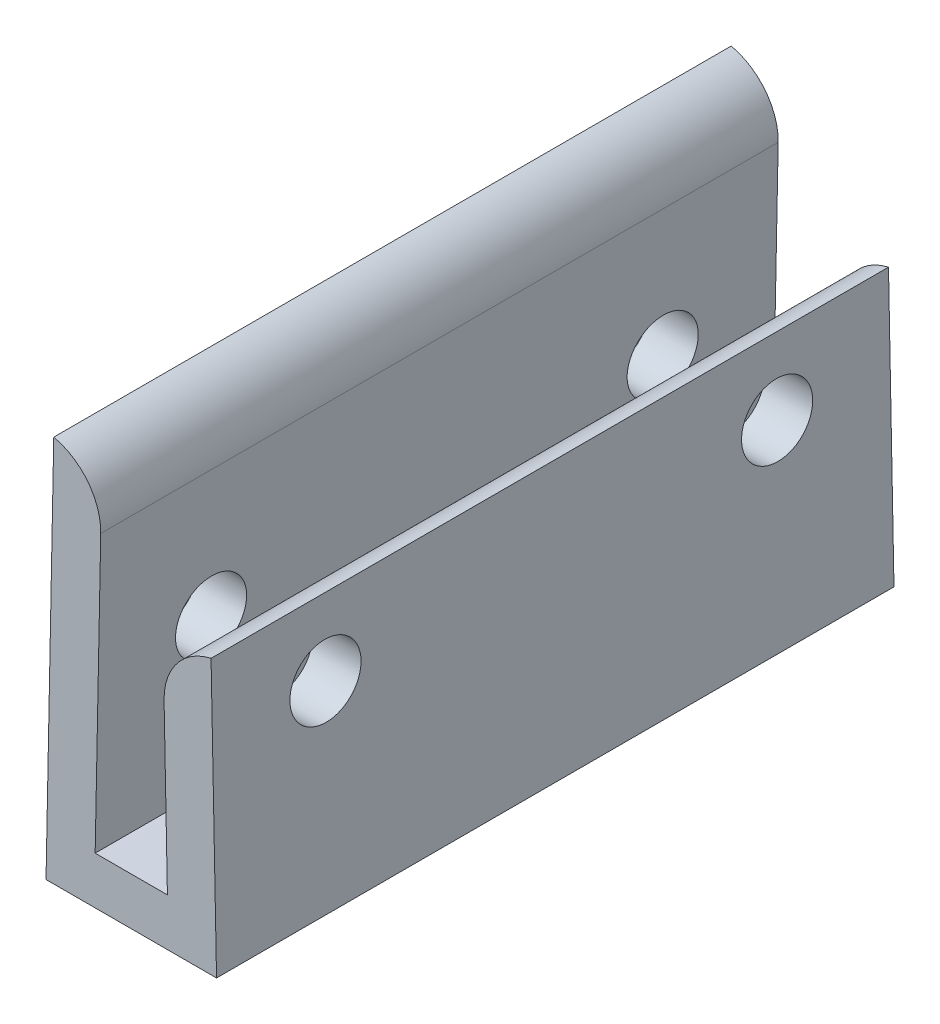
ISO-10303-21;
HEADER;
FILE_DESCRIPTION(('STEP AP214'),'2;1');
FILE_NAME('part.step','',(''),(''),'','','');
FILE_SCHEMA(('AUTOMOTIVE_DESIGN { 1 0 10303 214 1 1 1 1 }'));
ENDSEC;
DATA;
#1=APPLICATION_CONTEXT('core data for automotive mechanical design processes');
#2=APPLICATION_PROTOCOL_DEFINITION('international standard','automotive_design',2000,#1);
#3=PRODUCT_CONTEXT('',#1,'mechanical');
#4=PRODUCT('Part','Part','',(#3));
#5=PRODUCT_RELATED_PRODUCT_CATEGORY('part','',(#4));
#6=PRODUCT_DEFINITION_FORMATION('','',#4);
#7=PRODUCT_DEFINITION_CONTEXT('part definition',#1,'design');
#8=PRODUCT_DEFINITION('design','',#6,#7);
#9=PRODUCT_DEFINITION_SHAPE('','',#8);
#10=(LENGTH_UNIT() NAMED_UNIT(*) SI_UNIT(.MILLI.,.METRE.));
#11=(NAMED_UNIT(*) PLANE_ANGLE_UNIT() SI_UNIT($,.RADIAN.));
#12=(NAMED_UNIT(*) SI_UNIT($,.STERADIAN.) SOLID_ANGLE_UNIT());
#13=UNCERTAINTY_MEASURE_WITH_UNIT(LENGTH_MEASURE(1.E-05),#10,'distance_accuracy_value','');
#14=(GEOMETRIC_REPRESENTATION_CONTEXT(3) GLOBAL_UNCERTAINTY_ASSIGNED_CONTEXT((#13)) GLOBAL_UNIT_ASSIGNED_CONTEXT((#10,
#11,#12)) REPRESENTATION_CONTEXT('',''));
#15=CARTESIAN_POINT('',(0.,0.,0.));
#16=DIRECTION('',(0.,0.,1.));
#17=DIRECTION('',(1.,0.,0.));
#18=AXIS2_PLACEMENT_3D('',#15,#16,#17);
#19=CARTESIAN_POINT('',(-1.56338239919984,0.0312739033902781,28.575));
#20=DIRECTION('',(-0.999799979995999,0.02,0.));
#21=DIRECTION('',(-0.02,-0.999799979995999,0.));
#22=AXIS2_PLACEMENT_3D('',#19,#20,#21);
#23=PLANE('',#22);
#24=CARTESIAN_POINT('',(-1.3974064,8.32841393738108,4.7625));
#25=DIRECTION('',(-0.999799979995999,0.02,0.));
#26=DIRECTION('',(-0.02,-0.999799979995999,0.));
#27=AXIS2_PLACEMENT_3D('',#24,#25,#26);
#28=CIRCLE('',#27,1.5);
#29=CARTESIAN_POINT('',(-1.4274064,6.82871396738708,4.7625));
#30=VERTEX_POINT('',#29);
#31=EDGE_CURVE('E202',#30,#30,#28,.F.);
#32=ORIENTED_EDGE('',*,*,#31,.F.);
#33=EDGE_LOOP('',(#32));
#34=FACE_BOUND('',#33,.T.);
#35=CARTESIAN_POINT('',(-1.3974064,8.32841393738108,23.8125));
#36=DIRECTION('',(-0.999799979995999,0.02,0.));
#37=DIRECTION('',(-0.02,-0.999799979995999,0.));
#38=AXIS2_PLACEMENT_3D('',#35,#36,#37);
#39=CIRCLE('',#38,1.50000000000001);
#40=CARTESIAN_POINT('',(-1.4274064,6.82871396738707,23.8125));
#41=VERTEX_POINT('',#40);
#42=EDGE_CURVE('E205',#41,#41,#39,.F.);
#43=ORIENTED_EDGE('',*,*,#42,.F.);
#44=EDGE_LOOP('',(#43));
#45=FACE_BOUND('',#44,.T.);
#46=DIRECTION('',(0.02,0.999799979995999,0.));
#47=VECTOR('',#46,1.);
#48=CARTESIAN_POINT('',(-1.56338239919984,0.0312739033902781,0.));
#49=LINE('',#48,#47);
#50=CARTESIAN_POINT('',(-1.524,2.,0.));
#51=VERTEX_POINT('',#50);
#52=CARTESIAN_POINT('',(-1.28802363157335,13.7964584216244,0.));
#53=VERTEX_POINT('',#52);
#54=EDGE_CURVE('E207',#51,#53,#49,.T.);
#55=ORIENTED_EDGE('',*,*,#54,.T.);
#56=DIRECTION('',(0.,0.,-1.));
#57=VECTOR('',#56,1.);
#58=CARTESIAN_POINT('',(-1.28802363157335,13.7964584216244,28.575));
#59=LINE('',#58,#57);
#60=CARTESIAN_POINT('',(-1.28802363157335,13.7964584216244,28.575));
#61=VERTEX_POINT('',#60);
#62=EDGE_CURVE('E11',#53,#61,#59,.F.);
#63=ORIENTED_EDGE('',*,*,#62,.T.);
#64=DIRECTION('',(0.02,0.999799979995999,0.));
#65=VECTOR('',#64,1.);
#66=CARTESIAN_POINT('',(-1.56338239919984,0.0312739033902781,28.575));
#67=LINE('',#66,#65);
#68=CARTESIAN_POINT('',(-1.524,2.,28.575));
#69=VERTEX_POINT('',#68);
#70=EDGE_CURVE('E117',#69,#61,#67,.T.);
#71=ORIENTED_EDGE('',*,*,#70,.F.);
#72=DIRECTION('',(0.,0.,-1.));
#73=VECTOR('',#72,1.);
#74=CARTESIAN_POINT('',(-1.524,2.,28.575));
#75=LINE('',#74,#73);
#76=EDGE_CURVE('E209',#69,#51,#75,.T.);
#77=ORIENTED_EDGE('',*,*,#76,.T.);
#78=EDGE_LOOP('',(#55,#63,#71,#77));
#79=FACE_BOUND('',#78,.T.);
#80=ADVANCED_FACE('F36',(#34,#45,#79),#23,.F.);
#81=CARTESIAN_POINT('',(-3.59497595855171,0.0719139033902767,28.575));
#82=DIRECTION('',(0.999799979995999,-0.0199999999999997,0.));
#83=DIRECTION('',(0.0199999999999997,0.999799979995999,0.));
#84=AXIS2_PLACEMENT_3D('',#81,#82,#83);
#85=PLANE('',#84);
#86=CARTESIAN_POINT('',(-3.42899995935187,8.36905393738108,4.7625));
#87=DIRECTION('',(-0.999799979995999,0.0199999999999996,0.));
#88=DIRECTION('',(-0.0199999999999996,-0.999799979995999,0.));
#89=AXIS2_PLACEMENT_3D('',#86,#87,#88);
#90=CIRCLE('',#89,1.5);
#91=CARTESIAN_POINT('',(-3.45899995935187,6.86935396738708,4.7625));
#92=VERTEX_POINT('',#91);
#93=EDGE_CURVE('E276',#92,#92,#90,.T.);
#94=ORIENTED_EDGE('',*,*,#93,.F.);
#95=EDGE_LOOP('',(#94));
#96=FACE_BOUND('',#95,.T.);
#97=CARTESIAN_POINT('',(-3.42899995935187,8.36905393738108,23.8125));
#98=DIRECTION('',(-0.999799979995999,0.0199999999999996,0.));
#99=DIRECTION('',(-0.0199999999999996,-0.999799979995999,0.));
#100=AXIS2_PLACEMENT_3D('',#97,#98,#99);
#101=CIRCLE('',#100,1.50000000000001);
#102=CARTESIAN_POINT('',(-3.45899995935187,6.86935396738707,23.8125));
#103=VERTEX_POINT('',#102);
#104=EDGE_CURVE('E269',#103,#103,#101,.T.);
#105=ORIENTED_EDGE('',*,*,#104,.F.);
#106=EDGE_LOOP('',(#105));
#107=FACE_BOUND('',#106,.T.);
#108=DIRECTION('',(-0.0199999999999997,-0.999799979995999,0.));
#109=VECTOR('',#108,1.);
#110=CARTESIAN_POINT('',(-3.59497595855171,0.0719139033902767,0.));
#111=LINE('',#110,#109);
#112=CARTESIAN_POINT('',(-3.26984355935187,16.3252822141928,0.));
#113=VERTEX_POINT('',#112);
#114=CARTESIAN_POINT('',(-3.59641452436145,0.,0.));
#115=VERTEX_POINT('',#114);
#116=EDGE_CURVE('E211',#113,#115,#111,.T.);
#117=ORIENTED_EDGE('',*,*,#116,.T.);
#118=DIRECTION('',(0.,0.,-1.));
#119=VECTOR('',#118,1.);
#120=CARTESIAN_POINT('',(-3.59641452436145,0.,28.575));
#121=LINE('',#120,#119);
#122=CARTESIAN_POINT('',(-3.59641452436145,0.,28.575));
#123=VERTEX_POINT('',#122);
#124=EDGE_CURVE('E127',#123,#115,#121,.T.);
#125=ORIENTED_EDGE('',*,*,#124,.F.);
#126=DIRECTION('',(-0.0199999999999997,-0.999799979995999,0.));
#127=VECTOR('',#126,1.);
#128=CARTESIAN_POINT('',(-3.59497595855171,0.0719139033902767,28.575));
#129=LINE('',#128,#127);
#130=CARTESIAN_POINT('',(-3.26984355935187,16.3252822141928,28.575));
#131=VERTEX_POINT('',#130);
#132=EDGE_CURVE('E115',#131,#123,#129,.T.);
#133=ORIENTED_EDGE('',*,*,#132,.F.);
#134=DIRECTION('',(0.,0.,-1.));
#135=VECTOR('',#134,1.);
#136=CARTESIAN_POINT('',(-3.26984355935187,16.3252822141928,28.575));
#137=LINE('',#136,#135);
#138=EDGE_CURVE('E125',#131,#113,#137,.T.);
#139=ORIENTED_EDGE('',*,*,#138,.T.);
#140=EDGE_LOOP('',(#117,#125,#133,#139));
#141=FACE_BOUND('',#140,.T.);
#142=ADVANCED_FACE('F124',(#96,#107,#141),#85,.F.);
#143=CARTESIAN_POINT('',(0.,0.,28.575));
#144=DIRECTION('',(0.,1.,0.));
#145=DIRECTION('',(-1.,0.,0.));
#146=AXIS2_PLACEMENT_3D('',#143,#144,#145);
#147=PLANE('',#146);
#148=DIRECTION('',(1.,0.,0.));
#149=VECTOR('',#148,1.);
#150=CARTESIAN_POINT('',(0.,0.,0.));
#151=LINE('',#150,#149);
#152=CARTESIAN_POINT('',(3.59641452436145,0.,0.));
#153=VERTEX_POINT('',#152);
#154=EDGE_CURVE('E214',#115,#153,#151,.T.);
#155=ORIENTED_EDGE('',*,*,#154,.T.);
#156=DIRECTION('',(0.,0.,-1.));
#157=VECTOR('',#156,1.);
#158=CARTESIAN_POINT('',(3.59641452436145,0.,28.575));
#159=LINE('',#158,#157);
#160=CARTESIAN_POINT('',(3.59641452436145,0.,28.575));
#161=VERTEX_POINT('',#160);
#162=EDGE_CURVE('E135',#161,#153,#159,.T.);
#163=ORIENTED_EDGE('',*,*,#162,.F.);
#164=DIRECTION('',(1.,0.,0.));
#165=VECTOR('',#164,1.);
#166=CARTESIAN_POINT('',(0.,0.,28.575));
#167=LINE('',#166,#165);
#168=EDGE_CURVE('E129',#123,#161,#167,.T.);
#169=ORIENTED_EDGE('',*,*,#168,.F.);
#170=ORIENTED_EDGE('',*,*,#124,.T.);
#171=EDGE_LOOP('',(#155,#163,#169,#170));
#172=FACE_BOUND('',#171,.T.);
#173=ADVANCED_FACE('F188',(#172),#147,.F.);
#174=CARTESIAN_POINT('',(3.59497595855171,0.0719139033902767,28.575));
#175=DIRECTION('',(-0.999799979995999,-0.0199999999999997,0.));
#176=DIRECTION('',(0.0199999999999997,-0.999799979995999,0.));
#177=AXIS2_PLACEMENT_3D('',#174,#175,#176);
#178=PLANE('',#177);
#179=CARTESIAN_POINT('',(3.42859355935187,8.38936987297459,23.8125));
#180=DIRECTION('',(0.999799979995999,0.0199999999999996,0.));
#181=DIRECTION('',(-0.0199999999999996,0.999799979995999,0.));
#182=AXIS2_PLACEMENT_3D('',#179,#180,#181);
#183=CIRCLE('',#182,1.5);
#184=CARTESIAN_POINT('',(3.39859355935187,9.88906984296859,23.8125));
#185=VERTEX_POINT('',#184);
#186=EDGE_CURVE('E212',#185,#185,#183,.T.);
#187=ORIENTED_EDGE('',*,*,#186,.F.);
#188=EDGE_LOOP('',(#187));
#189=FACE_BOUND('',#188,.T.);
#190=CARTESIAN_POINT('',(3.42859355935187,8.38936987297459,4.7625));
#191=DIRECTION('',(0.999799979995999,0.0199999999999996,0.));
#192=DIRECTION('',(-0.0199999999999996,0.999799979995999,0.));
#193=AXIS2_PLACEMENT_3D('',#190,#191,#192);
#194=CIRCLE('',#193,1.5);
#195=CARTESIAN_POINT('',(3.39859355935187,9.88906984296859,4.7625));
#196=VERTEX_POINT('',#195);
#197=EDGE_CURVE('E263',#196,#196,#194,.T.);
#198=ORIENTED_EDGE('',*,*,#197,.F.);
#199=EDGE_LOOP('',(#198));
#200=FACE_BOUND('',#199,.T.);
#201=DIRECTION('',(-0.0199999999999997,0.999799979995999,0.));
#202=VECTOR('',#201,1.);
#203=CARTESIAN_POINT('',(3.59497595855171,0.0719139033902767,0.));
#204=LINE('',#203,#202);
#205=CARTESIAN_POINT('',(3.36509355935187,11.5637348094619,0.));
#206=VERTEX_POINT('',#205);
#207=EDGE_CURVE('E224',#153,#206,#204,.T.);
#208=ORIENTED_EDGE('',*,*,#207,.T.);
#209=DIRECTION('',(0.,0.,-1.));
#210=VECTOR('',#209,1.);
#211=CARTESIAN_POINT('',(3.36509355935187,11.5637348094619,28.575));
#212=LINE('',#211,#210);
#213=CARTESIAN_POINT('',(3.36509355935187,11.5637348094619,28.575));
#214=VERTEX_POINT('',#213);
#215=EDGE_CURVE('E235',#214,#206,#212,.T.);
#216=ORIENTED_EDGE('',*,*,#215,.F.);
#217=DIRECTION('',(-0.0199999999999997,0.999799979995999,0.));
#218=VECTOR('',#217,1.);
#219=CARTESIAN_POINT('',(3.59497595855171,0.0719139033902767,28.575));
#220=LINE('',#219,#218);
#221=EDGE_CURVE('E243',#161,#214,#220,.T.);
#222=ORIENTED_EDGE('',*,*,#221,.F.);
#223=ORIENTED_EDGE('',*,*,#162,.T.);
#224=EDGE_LOOP('',(#208,#216,#222,#223));
#225=FACE_BOUND('',#224,.T.);
#226=ADVANCED_FACE('F184',(#189,#200,#225),#178,.F.);
#227=CARTESIAN_POINT('',(1.56338239919984,0.0312739033902781,28.575));
#228=DIRECTION('',(0.999799979995999,0.02,0.));
#229=DIRECTION('',(-0.02,0.999799979995999,0.));
#230=AXIS2_PLACEMENT_3D('',#227,#228,#229);
#231=PLANE('',#230);
#232=DIRECTION('',(0.02,-0.999799979995999,0.));
#233=VECTOR('',#232,1.);
#234=CARTESIAN_POINT('',(1.56338239919984,0.0312739033902781,28.575));
#235=LINE('',#234,#233);
#236=CARTESIAN_POINT('',(1.38327363157335,9.0349110168935,28.575));
#237=VERTEX_POINT('',#236);
#238=CARTESIAN_POINT('',(1.524,2.,28.575));
#239=VERTEX_POINT('',#238);
#240=EDGE_CURVE('E252',#237,#239,#235,.T.);
#241=ORIENTED_EDGE('',*,*,#240,.F.);
#242=DIRECTION('',(0.,0.,-1.));
#243=VECTOR('',#242,1.);
#244=CARTESIAN_POINT('',(1.38327363157335,9.0349110168935,28.575));
#245=LINE('',#244,#243);
#246=CARTESIAN_POINT('',(1.38327363157335,9.0349110168935,25.1462792263114));
#247=VERTEX_POINT('',#246);
#248=EDGE_CURVE('E140',#237,#247,#245,.T.);
#249=ORIENTED_EDGE('',*,*,#248,.T.);
#250=CARTESIAN_POINT('',(1.397,8.34872987297459,23.8125));
#251=DIRECTION('',(0.999799979995999,0.02,0.));
#252=DIRECTION('',(-0.02,0.999799979995999,0.));
#253=AXIS2_PLACEMENT_3D('',#250,#251,#252);
#254=CIRCLE('',#253,1.5);
#255=CARTESIAN_POINT('',(1.38327363157335,9.0349110168935,22.4787207736886));
#256=VERTEX_POINT('',#255);
#257=EDGE_CURVE('E217',#256,#247,#254,.F.);
#258=ORIENTED_EDGE('',*,*,#257,.F.);
#259=DIRECTION('',(0.,0.,-1.));
#260=VECTOR('',#259,1.);
#261=CARTESIAN_POINT('',(1.38327363157335,9.0349110168935,28.575));
#262=LINE('',#261,#260);
#263=CARTESIAN_POINT('',(1.38327363157335,9.0349110168935,6.09627922631144));
#264=VERTEX_POINT('',#263);
#265=EDGE_CURVE('E133',#256,#264,#262,.T.);
#266=ORIENTED_EDGE('',*,*,#265,.T.);
#267=CARTESIAN_POINT('',(1.397,8.34872987297459,4.7625));
#268=DIRECTION('',(0.999799979995999,0.02,0.));
#269=DIRECTION('',(-0.02,0.999799979995999,0.));
#270=AXIS2_PLACEMENT_3D('',#267,#268,#269);
#271=CIRCLE('',#270,1.5);
#272=CARTESIAN_POINT('',(1.38327363157335,9.0349110168935,3.42872077368856));
#273=VERTEX_POINT('',#272);
#274=EDGE_CURVE('E266',#273,#264,#271,.F.);
#275=ORIENTED_EDGE('',*,*,#274,.F.);
#276=DIRECTION('',(0.,0.,-1.));
#277=VECTOR('',#276,1.);
#278=CARTESIAN_POINT('',(1.38327363157335,9.0349110168935,28.575));
#279=LINE('',#278,#277);
#280=CARTESIAN_POINT('',(1.38327363157335,9.0349110168935,0.));
#281=VERTEX_POINT('',#280);
#282=EDGE_CURVE('E131',#273,#281,#279,.T.);
#283=ORIENTED_EDGE('',*,*,#282,.T.);
#284=DIRECTION('',(0.02,-0.999799979995999,0.));
#285=VECTOR('',#284,1.);
#286=CARTESIAN_POINT('',(1.56338239919984,0.0312739033902781,0.));
#287=LINE('',#286,#285);
#288=CARTESIAN_POINT('',(1.524,2.,0.));
#289=VERTEX_POINT('',#288);
#290=EDGE_CURVE('E227',#281,#289,#287,.T.);
#291=ORIENTED_EDGE('',*,*,#290,.T.);
#292=DIRECTION('',(0.,0.,-1.));
#293=VECTOR('',#292,1.);
#294=CARTESIAN_POINT('',(1.524,2.,28.575));
#295=LINE('',#294,#293);
#296=EDGE_CURVE('E232',#239,#289,#295,.T.);
#297=ORIENTED_EDGE('',*,*,#296,.F.);
#298=EDGE_LOOP('',(#241,#249,#258,#266,#275,#283,#291,#297));
#299=FACE_BOUND('',#298,.T.);
#300=ADVANCED_FACE('F180',(#299),#231,.F.);
#301=CARTESIAN_POINT('',(0.,2.,28.575));
#302=DIRECTION('',(0.,-1.,0.));
#303=DIRECTION('',(0.,0.,-1.));
#304=AXIS2_PLACEMENT_3D('',#301,#302,#303);
#305=PLANE('',#304);
#306=DIRECTION('',(-1.,0.,0.));
#307=VECTOR('',#306,1.);
#308=CARTESIAN_POINT('',(0.,2.,0.));
#309=LINE('',#308,#307);
#310=EDGE_CURVE('E229',#289,#51,#309,.T.);
#311=ORIENTED_EDGE('',*,*,#310,.T.);
#312=ORIENTED_EDGE('',*,*,#76,.F.);
#313=DIRECTION('',(-1.,0.,0.));
#314=VECTOR('',#313,1.);
#315=CARTESIAN_POINT('',(0.,2.,28.575));
#316=LINE('',#315,#314);
#317=EDGE_CURVE('E220',#239,#69,#316,.T.);
#318=ORIENTED_EDGE('',*,*,#317,.F.);
#319=ORIENTED_EDGE('',*,*,#296,.T.);
#320=EDGE_LOOP('',(#311,#312,#318,#319));
#321=FACE_BOUND('',#320,.T.);
#322=ADVANCED_FACE('F175',(#321),#305,.F.);
#323=CARTESIAN_POINT('',(0.,0.,28.575));
#324=DIRECTION('',(0.,0.,1.));
#325=DIRECTION('',(1.,0.,0.));
#326=AXIS2_PLACEMENT_3D('',#323,#324,#325);
#327=PLANE('',#326);
#328=ORIENTED_EDGE('',*,*,#221,.T.);
#329=CARTESIAN_POINT('',(3.92276558076319,9.08571101689351,28.575));
#330=DIRECTION('',(0.,0.,1.));
#331=DIRECTION('',(1.,0.,0.));
#332=AXIS2_PLACEMENT_3D('',#329,#330,#331);
#333=CIRCLE('',#332,2.54);
#334=EDGE_CURVE('E44',#214,#237,#333,.T.);
#335=ORIENTED_EDGE('',*,*,#334,.T.);
#336=ORIENTED_EDGE('',*,*,#240,.T.);
#337=ORIENTED_EDGE('',*,*,#317,.T.);
#338=ORIENTED_EDGE('',*,*,#70,.T.);
#339=CARTESIAN_POINT('',(-3.82751558076319,13.8472584216244,28.575));
#340=DIRECTION('',(0.,0.,1.));
#341=DIRECTION('',(1.,0.,0.));
#342=AXIS2_PLACEMENT_3D('',#339,#340,#341);
#343=CIRCLE('',#342,2.54);
#344=EDGE_CURVE('E112',#61,#131,#343,.T.);
#345=ORIENTED_EDGE('',*,*,#344,.T.);
#346=ORIENTED_EDGE('',*,*,#132,.T.);
#347=ORIENTED_EDGE('',*,*,#168,.T.);
#348=EDGE_LOOP('',(#328,#335,#336,#337,#338,#345,#346,#347));
#349=FACE_BOUND('',#348,.T.);
#350=ADVANCED_FACE('F114',(#349),#327,.T.);
#351=CARTESIAN_POINT('',(0.,0.,0.));
#352=DIRECTION('',(0.,0.,1.));
#353=DIRECTION('',(1.,0.,0.));
#354=AXIS2_PLACEMENT_3D('',#351,#352,#353);
#355=PLANE('',#354);
#356=ORIENTED_EDGE('',*,*,#290,.F.);
#357=CARTESIAN_POINT('',(3.92276558076319,9.08571101689351,0.));
#358=DIRECTION('',(0.,0.,1.));
#359=DIRECTION('',(1.,0.,0.));
#360=AXIS2_PLACEMENT_3D('',#357,#358,#359);
#361=CIRCLE('',#360,2.54);
#362=EDGE_CURVE('E120',#281,#206,#361,.F.);
#363=ORIENTED_EDGE('',*,*,#362,.T.);
#364=ORIENTED_EDGE('',*,*,#207,.F.);
#365=ORIENTED_EDGE('',*,*,#154,.F.);
#366=ORIENTED_EDGE('',*,*,#116,.F.);
#367=CARTESIAN_POINT('',(-3.82751558076319,13.8472584216244,0.));
#368=DIRECTION('',(0.,0.,1.));
#369=DIRECTION('',(1.,0.,0.));
#370=AXIS2_PLACEMENT_3D('',#367,#368,#369);
#371=CIRCLE('',#370,2.54);
#372=EDGE_CURVE('E57',#113,#53,#371,.F.);
#373=ORIENTED_EDGE('',*,*,#372,.T.);
#374=ORIENTED_EDGE('',*,*,#54,.F.);
#375=ORIENTED_EDGE('',*,*,#310,.F.);
#376=EDGE_LOOP('',(#356,#363,#364,#365,#366,#373,#374,#375));
#377=FACE_BOUND('',#376,.T.);
#378=ADVANCED_FACE('F171',(#377),#355,.F.);
#379=CARTESIAN_POINT('',(-3.76237795375114,8.24552167019444,4.7625));
#380=DIRECTION('',(0.999799979995999,0.0199999999999996,0.));
#381=DIRECTION('',(-0.0199999999999996,0.999799979995999,0.));
#382=AXIS2_PLACEMENT_3D('',#379,#380,#381);
#383=CYLINDRICAL_SURFACE('',#382,1.5);
#384=ORIENTED_EDGE('',*,*,#197,.T.);
#385=EDGE_LOOP('',(#384));
#386=FACE_BOUND('',#385,.T.);
#387=ORIENTED_EDGE('',*,*,#274,.T.);
#388=CARTESIAN_POINT('',(1.38327363157335,9.0349110168935,6.09627922631144));
#389=CARTESIAN_POINT('',(1.38253675940557,9.07161041894605,6.07739307925798));
#390=CARTESIAN_POINT('',(1.38261738349306,9.10751936961995,6.05700071327543));
#391=CARTESIAN_POINT('',(1.38418417671342,9.17750566201752,6.01337106453969));
#392=CARTESIAN_POINT('',(1.38566952900155,9.21158405603393,5.99013544196652));
#393=CARTESIAN_POINT('',(1.39187424092776,9.31052128029186,5.91655695512465));
#394=CARTESIAN_POINT('',(1.39834027211592,9.37235088588592,5.86220353832808));
#395=CARTESIAN_POINT('',(1.41386077793421,9.486084941609,5.74453206206797));
#396=CARTESIAN_POINT('',(1.4229110533958,9.53800526693181,5.6812286291603));
#397=CARTESIAN_POINT('',(1.44152047470249,9.63093692094186,5.54705562839498));
#398=CARTESIAN_POINT('',(1.45107998946043,9.67194020829375,5.47618053690916));
#399=CARTESIAN_POINT('',(1.46909057250039,9.74335713836917,5.32554632475792));
#400=CARTESIAN_POINT('',(1.47748115646936,9.77327529335085,5.24554380048295));
#401=CARTESIAN_POINT('',(1.49082485848288,9.81908828665076,5.08136128296664));
#402=CARTESIAN_POINT('',(1.49577976368359,9.83499041693169,4.99718348605592));
#403=CARTESIAN_POINT('',(1.50105311177921,9.85186058361151,4.83006697770668));
#404=CARTESIAN_POINT('',(1.50152212639772,9.8533136785688,4.74718205763367));
#405=CARTESIAN_POINT('',(1.49811729954166,9.84248799531821,4.58241336382322));
#406=CARTESIAN_POINT('',(1.49424371889913,9.83021004184712,4.50052953025552));
#407=CARTESIAN_POINT('',(1.48313839135236,9.79294392065419,4.34242548699903));
#408=CARTESIAN_POINT('',(1.47600438768841,9.76832380446569,4.2661106913788));
#409=CARTESIAN_POINT('',(1.4598048630944,9.70733392755787,4.11851608947559));
#410=CARTESIAN_POINT('',(1.45073819421083,9.67095717704188,4.04723930929748));
#411=CARTESIAN_POINT('',(1.43200282107236,9.58541544594362,3.90815030480134));
#412=CARTESIAN_POINT('',(1.42232590673585,9.53572764849044,3.84066067763132));
#413=CARTESIAN_POINT('',(1.40501639641149,9.42574540552286,3.71474227544396));
#414=CARTESIAN_POINT('',(1.39738114093878,9.36546492953359,3.65630175517858));
#415=CARTESIAN_POINT('',(1.38839562556313,9.25967054019801,3.56959879680883));
#416=CARTESIAN_POINT('',(1.38576716084705,9.21685625791563,3.53813222985152));
#417=CARTESIAN_POINT('',(1.38272901217754,9.12810460454288,3.47984859442177));
#418=CARTESIAN_POINT('',(1.38231928263233,9.08216729764576,3.45303143042183));
#419=CARTESIAN_POINT('',(1.38327363157335,9.0349110168935,3.42872077368856));
#420=B_SPLINE_CURVE_WITH_KNOTS('',3,(#388,#389,#390,#391,#392,#393,#394,#395,#396,#397,#398,
#399,#400,#401,#402,#403,#404,#405,#406,#407,#408,#409,#410,#411,#412,#413,#414,#415,#416,#417,
#418,#419),.UNSPECIFIED.,.F.,.F.,(4,2,2,2,2,2,2,2,2,2,2,2,2,2,2,4),(0.,0.123747558990518,
0.247423203406603,0.493879366719757,0.73993731749376,0.986176012768652,1.24237589431272,
1.49844240675696,1.7458824427538,1.99330761739905,2.23375799457043,2.47435159305677,
2.7263077427982,2.97793407528117,3.13721488792967,3.29649242757683),.UNSPECIFIED.);
#421=EDGE_CURVE('E150',#264,#273,#420,.T.);
#422=ORIENTED_EDGE('',*,*,#421,.T.);
#423=EDGE_LOOP('',(#387,#422));
#424=FACE_BOUND('',#423,.T.);
#425=ADVANCED_FACE('F165',(#386,#424),#383,.F.);
#426=CARTESIAN_POINT('',(-3.76237795375114,8.24552167019444,23.8125));
#427=DIRECTION('',(0.999799979995999,0.0199999999999996,0.));
#428=DIRECTION('',(-0.0199999999999996,0.999799979995999,0.));
#429=AXIS2_PLACEMENT_3D('',#426,#427,#428);
#430=CYLINDRICAL_SURFACE('',#429,1.5);
#431=ORIENTED_EDGE('',*,*,#186,.T.);
#432=EDGE_LOOP('',(#431));
#433=FACE_BOUND('',#432,.T.);
#434=ORIENTED_EDGE('',*,*,#257,.T.);
#435=CARTESIAN_POINT('',(1.38327363157335,9.0349110168935,25.1462792263114));
#436=CARTESIAN_POINT('',(1.38253675940557,9.07161041894605,25.127393079258));
#437=CARTESIAN_POINT('',(1.38261738349306,9.10751936961995,25.1070007132754));
#438=CARTESIAN_POINT('',(1.38418417671342,9.17750566201752,25.0633710645397));
#439=CARTESIAN_POINT('',(1.38566952900155,9.21158405603393,25.0401354419665));
#440=CARTESIAN_POINT('',(1.39187424092776,9.31052128029186,24.9665569551247));
#441=CARTESIAN_POINT('',(1.39834027211593,9.37235088588593,24.9122035383281));
#442=CARTESIAN_POINT('',(1.41386077793421,9.48608494160901,24.794532062068));
#443=CARTESIAN_POINT('',(1.4229110533958,9.53800526693182,24.7312286291603));
#444=CARTESIAN_POINT('',(1.44152047470249,9.63093692094187,24.597055628395));
#445=CARTESIAN_POINT('',(1.45107998946043,9.67194020829375,24.5261805369092));
#446=CARTESIAN_POINT('',(1.46909057250039,9.74335713836917,24.3755463247579));
#447=CARTESIAN_POINT('',(1.47748115646936,9.77327529335085,24.295543800483));
#448=CARTESIAN_POINT('',(1.49082485848288,9.81908828665077,24.1313612829666));
#449=CARTESIAN_POINT('',(1.49577976368359,9.8349904169317,24.0471834860559));
#450=CARTESIAN_POINT('',(1.50105311177921,9.85186058361152,23.8800669777067));
#451=CARTESIAN_POINT('',(1.50152212639772,9.8533136785688,23.7971820576337));
#452=CARTESIAN_POINT('',(1.49811729954166,9.84248799531821,23.6324133638232));
#453=CARTESIAN_POINT('',(1.49424371889913,9.83021004184712,23.5505295302555));
#454=CARTESIAN_POINT('',(1.48313839135236,9.7929439206542,23.392425486999));
#455=CARTESIAN_POINT('',(1.47600438768842,9.76832380446569,23.3161106913788));
#456=CARTESIAN_POINT('',(1.45980486309441,9.70733392755787,23.1685160894756));
#457=CARTESIAN_POINT('',(1.45073819421083,9.67095717704189,23.0972393092975));
#458=CARTESIAN_POINT('',(1.43200282107236,9.58541544594362,22.9581503048013));
#459=CARTESIAN_POINT('',(1.42232590673585,9.53572764849045,22.8906606776313));
#460=CARTESIAN_POINT('',(1.40501639641149,9.42574540552286,22.764742275444));
#461=CARTESIAN_POINT('',(1.39738114093878,9.3654649295336,22.7063017551786));
#462=CARTESIAN_POINT('',(1.38839562556313,9.25967054019801,22.6195987968088));
#463=CARTESIAN_POINT('',(1.38576716084705,9.21685625791563,22.5881322298515));
#464=CARTESIAN_POINT('',(1.38272901217754,9.12810460454289,22.5298485944218));
#465=CARTESIAN_POINT('',(1.38231928263233,9.08216729764577,22.5030314304218));
#466=CARTESIAN_POINT('',(1.38327363157335,9.0349110168935,22.4787207736886));
#467=B_SPLINE_CURVE_WITH_KNOTS('',3,(#435,#436,#437,#438,#439,#440,#441,#442,#443,#444,#445,
#446,#447,#448,#449,#450,#451,#452,#453,#454,#455,#456,#457,#458,#459,#460,#461,#462,#463,#464,
#465,#466),.UNSPECIFIED.,.F.,.F.,(4,2,2,2,2,2,2,2,2,2,2,2,2,2,2,4),(0.,0.12374755899052,
0.247423203406605,0.493879366719762,0.739937317493768,0.986176012768662,1.24237589431273,
1.49844240675697,1.74588244275381,1.99330761739906,2.23375799457044,2.47435159305679,
2.72630774279821,2.97793407528118,3.13721488792969,3.29649242757684),.UNSPECIFIED.);
#468=EDGE_CURVE('E143',#247,#256,#467,.T.);
#469=ORIENTED_EDGE('',*,*,#468,.T.);
#470=EDGE_LOOP('',(#434,#469));
#471=FACE_BOUND('',#470,.T.);
#472=ADVANCED_FACE('F160',(#433,#471),#430,.F.);
#473=CARTESIAN_POINT('',(3.76197155375114,8.22520573460092,23.8125));
#474=DIRECTION('',(-0.999799979995999,0.0199999999999996,0.));
#475=DIRECTION('',(-0.0199999999999996,-0.999799979995999,0.));
#476=AXIS2_PLACEMENT_3D('',#473,#474,#475);
#477=CYLINDRICAL_SURFACE('',#476,1.50000000000001);
#478=ORIENTED_EDGE('',*,*,#104,.T.);
#479=EDGE_LOOP('',(#478));
#480=FACE_BOUND('',#479,.T.);
#481=ORIENTED_EDGE('',*,*,#42,.T.);
#482=EDGE_LOOP('',(#481));
#483=FACE_BOUND('',#482,.T.);
#484=ADVANCED_FACE('F164',(#480,#483),#477,.F.);
#485=CARTESIAN_POINT('',(3.76197155375114,8.22520573460092,4.7625));
#486=DIRECTION('',(-0.999799979995999,0.0199999999999996,0.));
#487=DIRECTION('',(-0.0199999999999996,-0.999799979995999,0.));
#488=AXIS2_PLACEMENT_3D('',#485,#486,#487);
#489=CYLINDRICAL_SURFACE('',#488,1.5);
#490=ORIENTED_EDGE('',*,*,#93,.T.);
#491=EDGE_LOOP('',(#490));
#492=FACE_BOUND('',#491,.T.);
#493=ORIENTED_EDGE('',*,*,#31,.T.);
#494=EDGE_LOOP('',(#493));
#495=FACE_BOUND('',#494,.T.);
#496=ADVANCED_FACE('F287',(#492,#495),#489,.F.);
#497=CARTESIAN_POINT('',(3.92276558076319,9.08571101689351,28.575));
#498=DIRECTION('',(0.,0.,-1.));
#499=DIRECTION('',(-1.,0.,0.));
#500=AXIS2_PLACEMENT_3D('',#497,#498,#499);
#501=CYLINDRICAL_SURFACE('',#500,2.54);
#502=ORIENTED_EDGE('',*,*,#334,.F.);
#503=ORIENTED_EDGE('',*,*,#215,.T.);
#504=ORIENTED_EDGE('',*,*,#362,.F.);
#505=ORIENTED_EDGE('',*,*,#282,.F.);
#506=ORIENTED_EDGE('',*,*,#421,.F.);
#507=ORIENTED_EDGE('',*,*,#265,.F.);
#508=ORIENTED_EDGE('',*,*,#468,.F.);
#509=ORIENTED_EDGE('',*,*,#248,.F.);
#510=EDGE_LOOP('',(#502,#503,#504,#505,#506,#507,#508,#509));
#511=FACE_BOUND('',#510,.T.);
#512=ADVANCED_FACE('F157',(#511),#501,.T.);
#513=CARTESIAN_POINT('',(-3.82751558076319,13.8472584216244,28.575));
#514=DIRECTION('',(0.,0.,-1.));
#515=DIRECTION('',(-1.,0.,0.));
#516=AXIS2_PLACEMENT_3D('',#513,#514,#515);
#517=CYLINDRICAL_SURFACE('',#516,2.54);
#518=ORIENTED_EDGE('',*,*,#344,.F.);
#519=ORIENTED_EDGE('',*,*,#62,.F.);
#520=ORIENTED_EDGE('',*,*,#372,.F.);
#521=ORIENTED_EDGE('',*,*,#138,.F.);
#522=EDGE_LOOP('',(#518,#519,#520,#521));
#523=FACE_BOUND('',#522,.T.);
#524=ADVANCED_FACE('F38',(#523),#517,.T.);
#525=CLOSED_SHELL('',(#80,#142,#173,#226,#300,#322,#350,#378,#425,#472,#484,#496,#512,#524));
#526=MANIFOLD_SOLID_BREP('B2',#525);
#527=ADVANCED_BREP_SHAPE_REPRESENTATION('',(#18,#526),#14);
#528=SHAPE_DEFINITION_REPRESENTATION(#9,#527);
ENDSEC;
END-ISO-10303-21;
